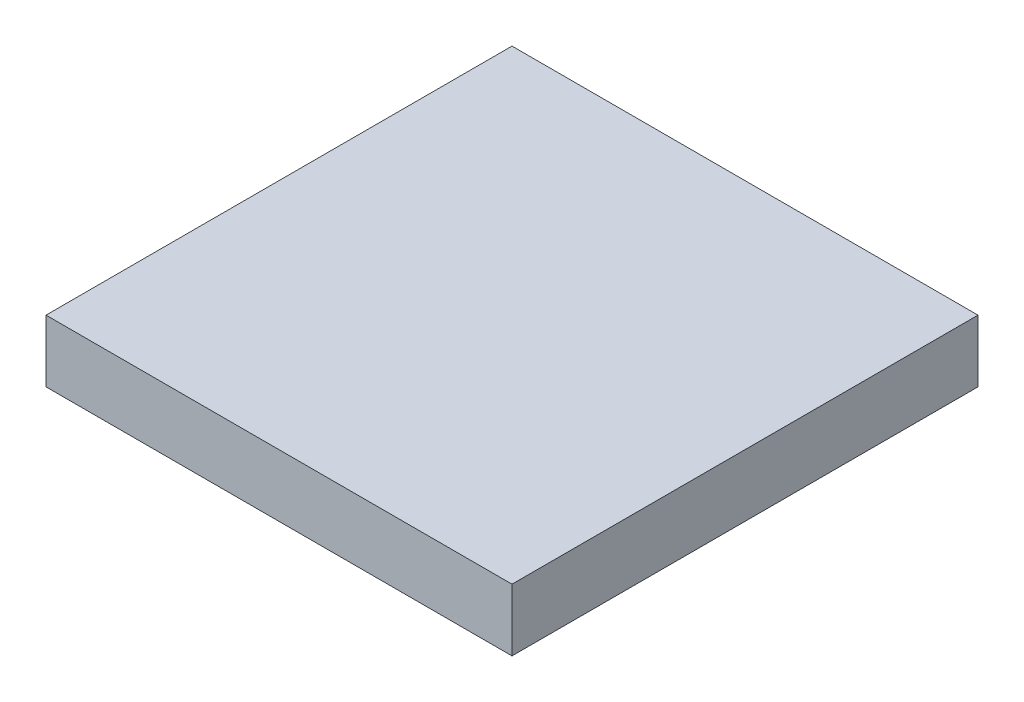
ISO-10303-21;
HEADER;
FILE_DESCRIPTION(('STEP AP214'),'2;1');
FILE_NAME('part.step','',(''),(''),'','','');
FILE_SCHEMA(('AUTOMOTIVE_DESIGN { 1 0 10303 214 1 1 1 1 }'));
ENDSEC;
DATA;
#1=APPLICATION_CONTEXT('core data for automotive mechanical design processes');
#2=APPLICATION_PROTOCOL_DEFINITION('international standard','automotive_design',2000,#1);
#3=PRODUCT_CONTEXT('',#1,'mechanical');
#4=PRODUCT('Part','Part','',(#3));
#5=PRODUCT_RELATED_PRODUCT_CATEGORY('part','',(#4));
#6=PRODUCT_DEFINITION_FORMATION('','',#4);
#7=PRODUCT_DEFINITION_CONTEXT('part definition',#1,'design');
#8=PRODUCT_DEFINITION('design','',#6,#7);
#9=PRODUCT_DEFINITION_SHAPE('','',#8);
#10=(LENGTH_UNIT() NAMED_UNIT(*) SI_UNIT(.MILLI.,.METRE.));
#11=(NAMED_UNIT(*) PLANE_ANGLE_UNIT() SI_UNIT($,.RADIAN.));
#12=(NAMED_UNIT(*) SI_UNIT($,.STERADIAN.) SOLID_ANGLE_UNIT());
#13=UNCERTAINTY_MEASURE_WITH_UNIT(LENGTH_MEASURE(1.E-05),#10,'distance_accuracy_value','');
#14=(GEOMETRIC_REPRESENTATION_CONTEXT(3) GLOBAL_UNCERTAINTY_ASSIGNED_CONTEXT((#13)) GLOBAL_UNIT_ASSIGNED_CONTEXT((#10,
#11,#12)) REPRESENTATION_CONTEXT('',''));
#15=CARTESIAN_POINT('',(0.,0.,0.));
#16=DIRECTION('',(0.,0.,1.));
#17=DIRECTION('',(1.,0.,0.));
#18=AXIS2_PLACEMENT_3D('',#15,#16,#17);
#19=CARTESIAN_POINT('',(0.,10.,0.));
#20=DIRECTION('',(1.,0.,0.));
#21=DIRECTION('',(0.,0.,-1.));
#22=AXIS2_PLACEMENT_3D('',#19,#20,#21);
#23=PLANE('',#22);
#24=DIRECTION('',(0.,0.,1.));
#25=VECTOR('',#24,1.);
#26=CARTESIAN_POINT('',(0.,0.,0.));
#27=LINE('',#26,#25);
#28=CARTESIAN_POINT('',(0.,0.,-75.));
#29=VERTEX_POINT('',#28);
#30=CARTESIAN_POINT('',(0.,0.,0.));
#31=VERTEX_POINT('',#30);
#32=EDGE_CURVE('E100',#29,#31,#27,.T.);
#33=ORIENTED_EDGE('',*,*,#32,.T.);
#34=DIRECTION('',(0.,-1.,0.));
#35=VECTOR('',#34,1.);
#36=CARTESIAN_POINT('',(0.,10.,0.));
#37=LINE('',#36,#35);
#38=CARTESIAN_POINT('',(0.,10.,0.));
#39=VERTEX_POINT('',#38);
#40=EDGE_CURVE('E11',#39,#31,#37,.T.);
#41=ORIENTED_EDGE('',*,*,#40,.F.);
#42=DIRECTION('',(0.,0.,1.));
#43=VECTOR('',#42,1.);
#44=CARTESIAN_POINT('',(0.,10.,0.));
#45=LINE('',#44,#43);
#46=CARTESIAN_POINT('',(0.,10.,-75.));
#47=VERTEX_POINT('',#46);
#48=EDGE_CURVE('E88',#47,#39,#45,.T.);
#49=ORIENTED_EDGE('',*,*,#48,.F.);
#50=DIRECTION('',(0.,-1.,0.));
#51=VECTOR('',#50,1.);
#52=CARTESIAN_POINT('',(0.,10.,-75.));
#53=LINE('',#52,#51);
#54=EDGE_CURVE('E96',#47,#29,#53,.T.);
#55=ORIENTED_EDGE('',*,*,#54,.T.);
#56=EDGE_LOOP('',(#33,#41,#49,#55));
#57=FACE_BOUND('',#56,.T.);
#58=ADVANCED_FACE('F37',(#57),#23,.F.);
#59=CARTESIAN_POINT('',(0.,10.,0.));
#60=DIRECTION('',(0.,0.,-1.));
#61=DIRECTION('',(-1.,0.,0.));
#62=AXIS2_PLACEMENT_3D('',#59,#60,#61);
#63=PLANE('',#62);
#64=DIRECTION('',(1.,0.,0.));
#65=VECTOR('',#64,1.);
#66=CARTESIAN_POINT('',(0.,0.,0.));
#67=LINE('',#66,#65);
#68=CARTESIAN_POINT('',(75.,0.,0.));
#69=VERTEX_POINT('',#68);
#70=EDGE_CURVE('E92',#31,#69,#67,.T.);
#71=ORIENTED_EDGE('',*,*,#70,.T.);
#72=DIRECTION('',(0.,-1.,0.));
#73=VECTOR('',#72,1.);
#74=CARTESIAN_POINT('',(75.,10.,0.));
#75=LINE('',#74,#73);
#76=CARTESIAN_POINT('',(75.,10.,0.));
#77=VERTEX_POINT('',#76);
#78=EDGE_CURVE('E45',#77,#69,#75,.T.);
#79=ORIENTED_EDGE('',*,*,#78,.F.);
#80=DIRECTION('',(1.,0.,0.));
#81=VECTOR('',#80,1.);
#82=CARTESIAN_POINT('',(0.,10.,0.));
#83=LINE('',#82,#81);
#84=EDGE_CURVE('E83',#39,#77,#83,.T.);
#85=ORIENTED_EDGE('',*,*,#84,.F.);
#86=ORIENTED_EDGE('',*,*,#40,.T.);
#87=EDGE_LOOP('',(#71,#79,#85,#86));
#88=FACE_BOUND('',#87,.T.);
#89=ADVANCED_FACE('F91',(#88),#63,.F.);
#90=CARTESIAN_POINT('',(75.,10.,0.));
#91=DIRECTION('',(-1.,0.,0.));
#92=DIRECTION('',(0.,0.,1.));
#93=AXIS2_PLACEMENT_3D('',#90,#91,#92);
#94=PLANE('',#93);
#95=DIRECTION('',(0.,0.,-1.));
#96=VECTOR('',#95,1.);
#97=CARTESIAN_POINT('',(75.,0.,0.));
#98=LINE('',#97,#96);
#99=CARTESIAN_POINT('',(75.,0.,-75.));
#100=VERTEX_POINT('',#99);
#101=EDGE_CURVE('E70',#69,#100,#98,.T.);
#102=ORIENTED_EDGE('',*,*,#101,.T.);
#103=DIRECTION('',(0.,-1.,0.));
#104=VECTOR('',#103,1.);
#105=CARTESIAN_POINT('',(75.,10.,-75.));
#106=LINE('',#105,#104);
#107=CARTESIAN_POINT('',(75.,10.,-75.));
#108=VERTEX_POINT('',#107);
#109=EDGE_CURVE('E93',#108,#100,#106,.T.);
#110=ORIENTED_EDGE('',*,*,#109,.F.);
#111=DIRECTION('',(0.,0.,-1.));
#112=VECTOR('',#111,1.);
#113=CARTESIAN_POINT('',(75.,10.,0.));
#114=LINE('',#113,#112);
#115=EDGE_CURVE('E86',#77,#108,#114,.T.);
#116=ORIENTED_EDGE('',*,*,#115,.F.);
#117=ORIENTED_EDGE('',*,*,#78,.T.);
#118=EDGE_LOOP('',(#102,#110,#116,#117));
#119=FACE_BOUND('',#118,.T.);
#120=ADVANCED_FACE('F94',(#119),#94,.F.);
#121=CARTESIAN_POINT('',(0.,10.,-75.));
#122=DIRECTION('',(0.,0.,1.));
#123=DIRECTION('',(1.,0.,0.));
#124=AXIS2_PLACEMENT_3D('',#121,#122,#123);
#125=PLANE('',#124);
#126=DIRECTION('',(-1.,0.,0.));
#127=VECTOR('',#126,1.);
#128=CARTESIAN_POINT('',(0.,0.,-75.));
#129=LINE('',#128,#127);
#130=EDGE_CURVE('E76',#100,#29,#129,.T.);
#131=ORIENTED_EDGE('',*,*,#130,.T.);
#132=ORIENTED_EDGE('',*,*,#54,.F.);
#133=DIRECTION('',(-1.,0.,0.));
#134=VECTOR('',#133,1.);
#135=CARTESIAN_POINT('',(0.,10.,-75.));
#136=LINE('',#135,#134);
#137=EDGE_CURVE('E53',#108,#47,#136,.T.);
#138=ORIENTED_EDGE('',*,*,#137,.F.);
#139=ORIENTED_EDGE('',*,*,#109,.T.);
#140=EDGE_LOOP('',(#131,#132,#138,#139));
#141=FACE_BOUND('',#140,.T.);
#142=ADVANCED_FACE('F107',(#141),#125,.F.);
#143=CARTESIAN_POINT('',(0.,10.,0.));
#144=DIRECTION('',(0.,-1.,0.));
#145=DIRECTION('',(0.,0.,-1.));
#146=AXIS2_PLACEMENT_3D('',#143,#144,#145);
#147=PLANE('',#146);
#148=ORIENTED_EDGE('',*,*,#48,.T.);
#149=ORIENTED_EDGE('',*,*,#84,.T.);
#150=ORIENTED_EDGE('',*,*,#115,.T.);
#151=ORIENTED_EDGE('',*,*,#137,.T.);
#152=EDGE_LOOP('',(#148,#149,#150,#151));
#153=FACE_BOUND('',#152,.T.);
#154=ADVANCED_FACE('F84',(#153),#147,.F.);
#155=CARTESIAN_POINT('',(0.,0.,0.));
#156=DIRECTION('',(0.,-1.,0.));
#157=DIRECTION('',(0.,0.,-1.));
#158=AXIS2_PLACEMENT_3D('',#155,#156,#157);
#159=PLANE('',#158);
#160=ORIENTED_EDGE('',*,*,#32,.F.);
#161=ORIENTED_EDGE('',*,*,#130,.F.);
#162=ORIENTED_EDGE('',*,*,#101,.F.);
#163=ORIENTED_EDGE('',*,*,#70,.F.);
#164=EDGE_LOOP('',(#160,#161,#162,#163));
#165=FACE_BOUND('',#164,.T.);
#166=ADVANCED_FACE('F110',(#165),#159,.T.);
#167=CLOSED_SHELL('',(#58,#89,#120,#142,#154,#166));
#168=MANIFOLD_SOLID_BREP('B2',#167);
#169=ADVANCED_BREP_SHAPE_REPRESENTATION('',(#18,#168),#14);
#170=SHAPE_DEFINITION_REPRESENTATION(#9,#169);
ENDSEC;
END-ISO-10303-21;
